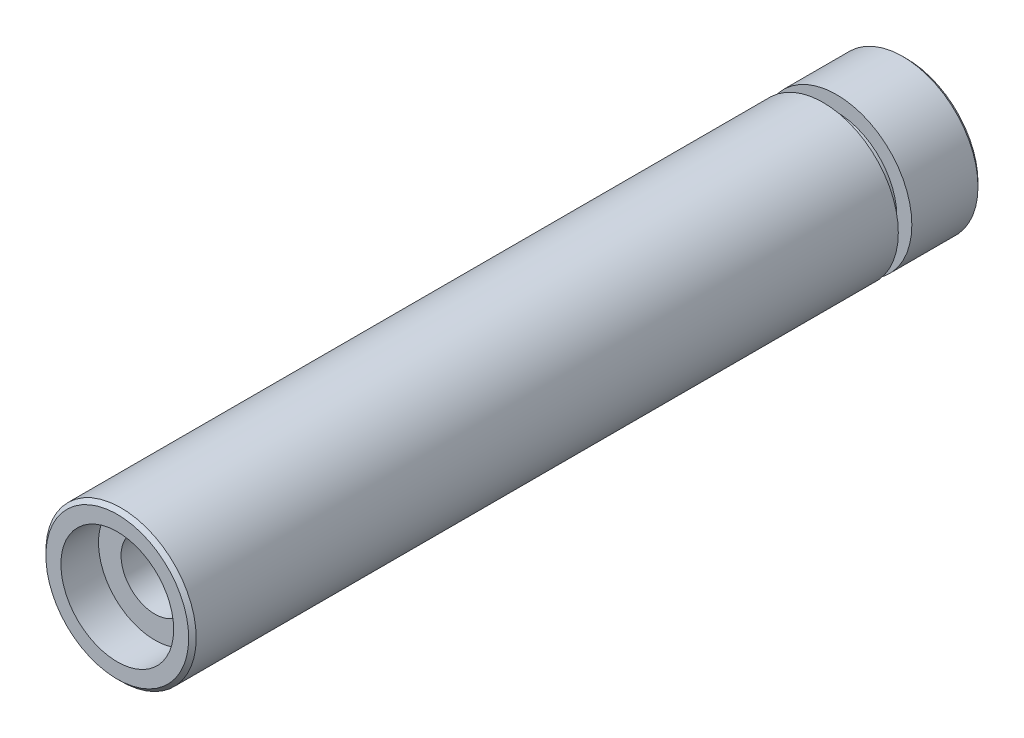
ISO-10303-21;
HEADER;
FILE_DESCRIPTION(('STEP AP214'),'2;1');
FILE_NAME('part.step','',(''),(''),'','','');
FILE_SCHEMA(('AUTOMOTIVE_DESIGN { 1 0 10303 214 1 1 1 1 }'));
ENDSEC;
DATA;
#1=APPLICATION_CONTEXT('core data for automotive mechanical design processes');
#2=APPLICATION_PROTOCOL_DEFINITION('international standard','automotive_design',2000,#1);
#3=PRODUCT_CONTEXT('',#1,'mechanical');
#4=PRODUCT('Part','Part','',(#3));
#5=PRODUCT_RELATED_PRODUCT_CATEGORY('part','',(#4));
#6=PRODUCT_DEFINITION_FORMATION('','',#4);
#7=PRODUCT_DEFINITION_CONTEXT('part definition',#1,'design');
#8=PRODUCT_DEFINITION('design','',#6,#7);
#9=PRODUCT_DEFINITION_SHAPE('','',#8);
#10=(LENGTH_UNIT() NAMED_UNIT(*) SI_UNIT(.MILLI.,.METRE.));
#11=(NAMED_UNIT(*) PLANE_ANGLE_UNIT() SI_UNIT($,.RADIAN.));
#12=(NAMED_UNIT(*) SI_UNIT($,.STERADIAN.) SOLID_ANGLE_UNIT());
#13=UNCERTAINTY_MEASURE_WITH_UNIT(LENGTH_MEASURE(1.E-05),#10,'distance_accuracy_value','');
#14=(GEOMETRIC_REPRESENTATION_CONTEXT(3) GLOBAL_UNCERTAINTY_ASSIGNED_CONTEXT((#13)) GLOBAL_UNIT_ASSIGNED_CONTEXT((#10,
#11,#12)) REPRESENTATION_CONTEXT('',''));
#15=CARTESIAN_POINT('',(0.,0.,0.));
#16=DIRECTION('',(0.,0.,1.));
#17=DIRECTION('',(1.,0.,0.));
#18=AXIS2_PLACEMENT_3D('',#15,#16,#17);
#19=CARTESIAN_POINT('',(0.,0.,9.3));
#20=DIRECTION('',(0.,0.,-1.));
#21=DIRECTION('',(-1.,0.,0.));
#22=AXIS2_PLACEMENT_3D('',#19,#20,#21);
#23=CYLINDRICAL_SURFACE('',#22,10.);
#24=CARTESIAN_POINT('',(0.,0.,0.500000000000013));
#25=DIRECTION('',(0.,0.,1.));
#26=DIRECTION('',(1.,0.,0.));
#27=AXIS2_PLACEMENT_3D('',#24,#25,#26);
#28=CIRCLE('',#27,10.);
#29=CARTESIAN_POINT('',(10.,0.,0.500000000000013));
#30=VERTEX_POINT('',#29);
#31=EDGE_CURVE('E38',#30,#30,#28,.T.);
#32=ORIENTED_EDGE('',*,*,#31,.T.);
#33=EDGE_LOOP('',(#32));
#34=FACE_BOUND('',#33,.T.);
#35=CARTESIAN_POINT('',(0.,0.,9.3));
#36=DIRECTION('',(0.,0.,1.));
#37=DIRECTION('',(1.,0.,0.));
#38=AXIS2_PLACEMENT_3D('',#35,#36,#37);
#39=CIRCLE('',#38,10.);
#40=CARTESIAN_POINT('',(10.,0.,9.3));
#41=VERTEX_POINT('',#40);
#42=EDGE_CURVE('E51',#41,#41,#39,.T.);
#43=ORIENTED_EDGE('',*,*,#42,.F.);
#44=EDGE_LOOP('',(#43));
#45=FACE_BOUND('',#44,.T.);
#46=ADVANCED_FACE('F31',(#34,#45),#23,.T.);
#47=CARTESIAN_POINT('',(0.,0.,9.3));
#48=DIRECTION('',(0.,0.,1.));
#49=DIRECTION('',(1.,0.,0.));
#50=AXIS2_PLACEMENT_3D('',#47,#48,#49);
#51=PLANE('',#50);
#52=CARTESIAN_POINT('',(0.,0.,9.3));
#53=DIRECTION('',(0.,0.,1.));
#54=DIRECTION('',(1.,0.,0.));
#55=AXIS2_PLACEMENT_3D('',#52,#53,#54);
#56=CIRCLE('',#55,8.);
#57=CARTESIAN_POINT('',(8.,0.,9.3));
#58=VERTEX_POINT('',#57);
#59=EDGE_CURVE('E55',#58,#58,#56,.T.);
#60=ORIENTED_EDGE('',*,*,#59,.F.);
#61=EDGE_LOOP('',(#60));
#62=FACE_BOUND('',#61,.T.);
#63=ORIENTED_EDGE('',*,*,#42,.T.);
#64=EDGE_LOOP('',(#63));
#65=FACE_BOUND('',#64,.T.);
#66=ADVANCED_FACE('F110',(#62,#65),#51,.T.);
#67=CARTESIAN_POINT('',(0.,0.,0.));
#68=DIRECTION('',(0.,0.,1.));
#69=DIRECTION('',(1.,0.,0.));
#70=AXIS2_PLACEMENT_3D('',#67,#68,#69);
#71=PLANE('',#70);
#72=CARTESIAN_POINT('',(0.,0.,0.));
#73=DIRECTION('',(0.,0.,1.));
#74=DIRECTION('',(1.,0.,0.));
#75=AXIS2_PLACEMENT_3D('',#72,#73,#74);
#76=CIRCLE('',#75,9.49999999999998);
#77=CARTESIAN_POINT('',(9.49999999999998,0.,0.));
#78=VERTEX_POINT('',#77);
#79=EDGE_CURVE('E10',#78,#78,#76,.F.);
#80=ORIENTED_EDGE('',*,*,#79,.T.);
#81=EDGE_LOOP('',(#80));
#82=FACE_BOUND('',#81,.T.);
#83=CARTESIAN_POINT('',(0.,0.,0.));
#84=DIRECTION('',(0.,0.,-1.));
#85=DIRECTION('',(-1.,0.,0.));
#86=AXIS2_PLACEMENT_3D('',#83,#84,#85);
#87=CIRCLE('',#86,7.5);
#88=CARTESIAN_POINT('',(-7.5,0.,0.));
#89=VERTEX_POINT('',#88);
#90=EDGE_CURVE('E64',#89,#89,#87,.T.);
#91=ORIENTED_EDGE('',*,*,#90,.F.);
#92=EDGE_LOOP('',(#91));
#93=FACE_BOUND('',#92,.T.);
#94=ADVANCED_FACE('F115',(#82,#93),#71,.F.);
#95=CARTESIAN_POINT('',(0.,0.,11.1));
#96=DIRECTION('',(0.,0.,-1.));
#97=DIRECTION('',(-1.,0.,0.));
#98=AXIS2_PLACEMENT_3D('',#95,#96,#97);
#99=CYLINDRICAL_SURFACE('',#98,8.);
#100=CARTESIAN_POINT('',(0.,0.,11.1));
#101=DIRECTION('',(0.,0.,1.));
#102=DIRECTION('',(1.,0.,0.));
#103=AXIS2_PLACEMENT_3D('',#100,#101,#102);
#104=CIRCLE('',#103,8.);
#105=CARTESIAN_POINT('',(8.,0.,11.1));
#106=VERTEX_POINT('',#105);
#107=EDGE_CURVE('E54',#106,#106,#104,.T.);
#108=ORIENTED_EDGE('',*,*,#107,.F.);
#109=EDGE_LOOP('',(#108));
#110=FACE_BOUND('',#109,.T.);
#111=ORIENTED_EDGE('',*,*,#59,.T.);
#112=EDGE_LOOP('',(#111));
#113=FACE_BOUND('',#112,.T.);
#114=ADVANCED_FACE('F105',(#110,#113),#99,.T.);
#115=CARTESIAN_POINT('',(0.,0.,105.));
#116=DIRECTION('',(0.,0.,-1.));
#117=DIRECTION('',(-1.,0.,0.));
#118=AXIS2_PLACEMENT_3D('',#115,#116,#117);
#119=CYLINDRICAL_SURFACE('',#118,10.);
#120=CARTESIAN_POINT('',(0.,0.,104.5));
#121=DIRECTION('',(0.,0.,1.));
#122=DIRECTION('',(1.,0.,0.));
#123=AXIS2_PLACEMENT_3D('',#120,#121,#122);
#124=CIRCLE('',#123,10.);
#125=CARTESIAN_POINT('',(10.,0.,104.5));
#126=VERTEX_POINT('',#125);
#127=EDGE_CURVE('E42',#126,#126,#124,.F.);
#128=ORIENTED_EDGE('',*,*,#127,.T.);
#129=EDGE_LOOP('',(#128));
#130=FACE_BOUND('',#129,.T.);
#131=CARTESIAN_POINT('',(0.,0.,11.1));
#132=DIRECTION('',(0.,0.,1.));
#133=DIRECTION('',(1.,0.,0.));
#134=AXIS2_PLACEMENT_3D('',#131,#132,#133);
#135=CIRCLE('',#134,10.);
#136=CARTESIAN_POINT('',(10.,0.,11.1));
#137=VERTEX_POINT('',#136);
#138=EDGE_CURVE('E58',#137,#137,#135,.T.);
#139=ORIENTED_EDGE('',*,*,#138,.T.);
#140=EDGE_LOOP('',(#139));
#141=FACE_BOUND('',#140,.T.);
#142=ADVANCED_FACE('F95',(#130,#141),#119,.T.);
#143=CARTESIAN_POINT('',(0.,0.,105.));
#144=DIRECTION('',(0.,0.,1.));
#145=DIRECTION('',(1.,0.,0.));
#146=AXIS2_PLACEMENT_3D('',#143,#144,#145);
#147=PLANE('',#146);
#148=CARTESIAN_POINT('',(0.,0.,105.));
#149=DIRECTION('',(0.,0.,1.));
#150=DIRECTION('',(1.,0.,0.));
#151=AXIS2_PLACEMENT_3D('',#148,#149,#150);
#152=CIRCLE('',#151,9.49999999999999);
#153=CARTESIAN_POINT('',(9.49999999999999,0.,105.));
#154=VERTEX_POINT('',#153);
#155=EDGE_CURVE('E46',#154,#154,#152,.T.);
#156=ORIENTED_EDGE('',*,*,#155,.T.);
#157=EDGE_LOOP('',(#156));
#158=FACE_BOUND('',#157,.T.);
#159=CARTESIAN_POINT('',(0.,0.,105.));
#160=DIRECTION('',(0.,0.,1.));
#161=DIRECTION('',(1.,0.,0.));
#162=AXIS2_PLACEMENT_3D('',#159,#160,#161);
#163=CIRCLE('',#162,7.5);
#164=CARTESIAN_POINT('',(7.5,0.,105.));
#165=VERTEX_POINT('',#164);
#166=EDGE_CURVE('E76',#165,#165,#163,.T.);
#167=ORIENTED_EDGE('',*,*,#166,.F.);
#168=EDGE_LOOP('',(#167));
#169=FACE_BOUND('',#168,.T.);
#170=ADVANCED_FACE('F92',(#158,#169),#147,.T.);
#171=CARTESIAN_POINT('',(0.,0.,11.1));
#172=DIRECTION('',(0.,0.,1.));
#173=DIRECTION('',(1.,0.,0.));
#174=AXIS2_PLACEMENT_3D('',#171,#172,#173);
#175=PLANE('',#174);
#176=ORIENTED_EDGE('',*,*,#107,.T.);
#177=EDGE_LOOP('',(#176));
#178=FACE_BOUND('',#177,.T.);
#179=ORIENTED_EDGE('',*,*,#138,.F.);
#180=EDGE_LOOP('',(#179));
#181=FACE_BOUND('',#180,.T.);
#182=ADVANCED_FACE('F94',(#178,#181),#175,.F.);
#183=CARTESIAN_POINT('',(0.,0.,5.));
#184=DIRECTION('',(0.,0.,-1.));
#185=DIRECTION('',(-1.,0.,0.));
#186=AXIS2_PLACEMENT_3D('',#183,#184,#185);
#187=CYLINDRICAL_SURFACE('',#186,7.5);
#188=CARTESIAN_POINT('',(0.,0.,5.));
#189=DIRECTION('',(0.,0.,-1.));
#190=DIRECTION('',(-1.,0.,0.));
#191=AXIS2_PLACEMENT_3D('',#188,#189,#190);
#192=CIRCLE('',#191,7.5);
#193=CARTESIAN_POINT('',(-7.5,0.,5.));
#194=VERTEX_POINT('',#193);
#195=EDGE_CURVE('E63',#194,#194,#192,.T.);
#196=ORIENTED_EDGE('',*,*,#195,.F.);
#197=EDGE_LOOP('',(#196));
#198=FACE_BOUND('',#197,.T.);
#199=ORIENTED_EDGE('',*,*,#90,.T.);
#200=EDGE_LOOP('',(#199));
#201=FACE_BOUND('',#200,.T.);
#202=ADVANCED_FACE('F102',(#198,#201),#187,.F.);
#203=CARTESIAN_POINT('',(0.,0.,5.));
#204=DIRECTION('',(0.,0.,-1.));
#205=DIRECTION('',(-1.,0.,0.));
#206=AXIS2_PLACEMENT_3D('',#203,#204,#205);
#207=PLANE('',#206);
#208=CARTESIAN_POINT('',(0.,0.,5.));
#209=DIRECTION('',(0.,0.,-1.));
#210=DIRECTION('',(-1.,0.,0.));
#211=AXIS2_PLACEMENT_3D('',#208,#209,#210);
#212=CIRCLE('',#211,4.5);
#213=CARTESIAN_POINT('',(-4.5,0.,5.));
#214=VERTEX_POINT('',#213);
#215=EDGE_CURVE('E67',#214,#214,#212,.T.);
#216=ORIENTED_EDGE('',*,*,#215,.F.);
#217=EDGE_LOOP('',(#216));
#218=FACE_BOUND('',#217,.T.);
#219=ORIENTED_EDGE('',*,*,#195,.T.);
#220=EDGE_LOOP('',(#219));
#221=FACE_BOUND('',#220,.T.);
#222=ADVANCED_FACE('F188',(#218,#221),#207,.T.);
#223=CARTESIAN_POINT('',(0.,0.,100.));
#224=DIRECTION('',(0.,0.,-1.));
#225=DIRECTION('',(-1.,0.,0.));
#226=AXIS2_PLACEMENT_3D('',#223,#224,#225);
#227=CYLINDRICAL_SURFACE('',#226,4.5);
#228=CARTESIAN_POINT('',(0.,0.,100.));
#229=DIRECTION('',(0.,0.,1.));
#230=DIRECTION('',(1.,0.,0.));
#231=AXIS2_PLACEMENT_3D('',#228,#229,#230);
#232=CIRCLE('',#231,4.5);
#233=CARTESIAN_POINT('',(4.5,0.,100.));
#234=VERTEX_POINT('',#233);
#235=EDGE_CURVE('E72',#234,#234,#232,.F.);
#236=ORIENTED_EDGE('',*,*,#235,.F.);
#237=EDGE_LOOP('',(#236));
#238=FACE_BOUND('',#237,.T.);
#239=ORIENTED_EDGE('',*,*,#215,.T.);
#240=EDGE_LOOP('',(#239));
#241=FACE_BOUND('',#240,.T.);
#242=ADVANCED_FACE('F179',(#238,#241),#227,.F.);
#243=CARTESIAN_POINT('',(0.,0.,100.));
#244=DIRECTION('',(0.,0.,1.));
#245=DIRECTION('',(1.,0.,0.));
#246=AXIS2_PLACEMENT_3D('',#243,#244,#245);
#247=PLANE('',#246);
#248=CARTESIAN_POINT('',(0.,0.,100.));
#249=DIRECTION('',(0.,0.,1.));
#250=DIRECTION('',(1.,0.,0.));
#251=AXIS2_PLACEMENT_3D('',#248,#249,#250);
#252=CIRCLE('',#251,7.5);
#253=CARTESIAN_POINT('',(7.5,0.,100.));
#254=VERTEX_POINT('',#253);
#255=EDGE_CURVE('E75',#254,#254,#252,.T.);
#256=ORIENTED_EDGE('',*,*,#255,.T.);
#257=EDGE_LOOP('',(#256));
#258=FACE_BOUND('',#257,.T.);
#259=ORIENTED_EDGE('',*,*,#235,.T.);
#260=EDGE_LOOP('',(#259));
#261=FACE_BOUND('',#260,.T.);
#262=ADVANCED_FACE('F82',(#258,#261),#247,.T.);
#263=CARTESIAN_POINT('',(0.,0.,100.));
#264=DIRECTION('',(0.,0.,1.));
#265=DIRECTION('',(1.,0.,0.));
#266=AXIS2_PLACEMENT_3D('',#263,#264,#265);
#267=CYLINDRICAL_SURFACE('',#266,7.5);
#268=ORIENTED_EDGE('',*,*,#255,.F.);
#269=EDGE_LOOP('',(#268));
#270=FACE_BOUND('',#269,.T.);
#271=ORIENTED_EDGE('',*,*,#166,.T.);
#272=EDGE_LOOP('',(#271));
#273=FACE_BOUND('',#272,.T.);
#274=ADVANCED_FACE('F85',(#270,#273),#267,.F.);
#275=CARTESIAN_POINT('',(0.,0.,105.));
#276=DIRECTION('',(0.,0.,-1.));
#277=DIRECTION('',(-1.,0.,0.));
#278=AXIS2_PLACEMENT_3D('',#275,#276,#277);
#279=CONICAL_SURFACE('',#278,9.49999999999999,0.78539816339744);
#280=ORIENTED_EDGE('',*,*,#127,.F.);
#281=EDGE_LOOP('',(#280));
#282=FACE_BOUND('',#281,.T.);
#283=ORIENTED_EDGE('',*,*,#155,.F.);
#284=EDGE_LOOP('',(#283));
#285=FACE_BOUND('',#284,.T.);
#286=ADVANCED_FACE('F88',(#282,#285),#279,.T.);
#287=CARTESIAN_POINT('',(0.,0.,0.500000000000013));
#288=DIRECTION('',(0.,0.,1.));
#289=DIRECTION('',(1.,0.,0.));
#290=AXIS2_PLACEMENT_3D('',#287,#288,#289);
#291=CONICAL_SURFACE('',#290,10.,0.785398163397455);
#292=ORIENTED_EDGE('',*,*,#79,.F.);
#293=EDGE_LOOP('',(#292));
#294=FACE_BOUND('',#293,.T.);
#295=ORIENTED_EDGE('',*,*,#31,.F.);
#296=EDGE_LOOP('',(#295));
#297=FACE_BOUND('',#296,.T.);
#298=ADVANCED_FACE('F33',(#294,#297),#291,.T.);
#299=CLOSED_SHELL('',(#46,#66,#94,#114,#142,#170,#182,#202,#222,#242,#262,#274,#286,#298));
#300=MANIFOLD_SOLID_BREP('B2',#299);
#301=ADVANCED_BREP_SHAPE_REPRESENTATION('',(#18,#300),#14);
#302=SHAPE_DEFINITION_REPRESENTATION(#9,#301);
ENDSEC;
END-ISO-10303-21;
